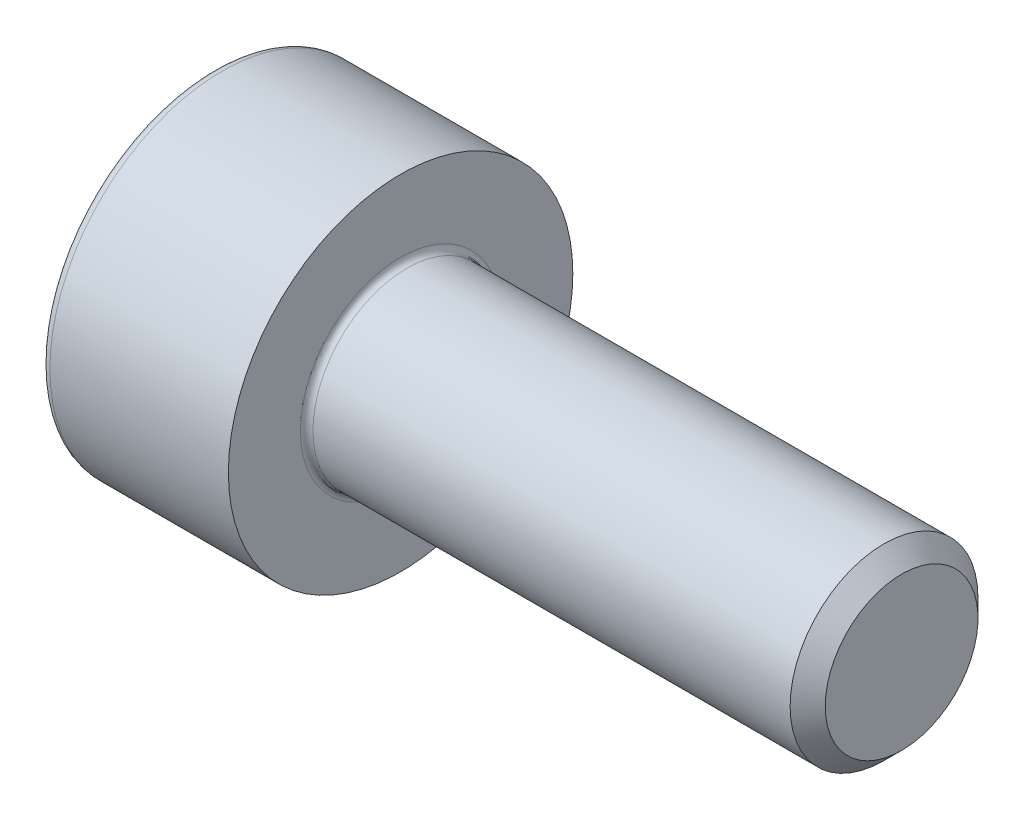
ISO-10303-21;
HEADER;
FILE_DESCRIPTION(('STEP AP214'),'2;1');
FILE_NAME('part.step','',(''),(''),'','','');
FILE_SCHEMA(('AUTOMOTIVE_DESIGN { 1 0 10303 214 1 1 1 1 }'));
ENDSEC;
DATA;
#1=APPLICATION_CONTEXT('core data for automotive mechanical design processes');
#2=APPLICATION_PROTOCOL_DEFINITION('international standard','automotive_design',2000,#1);
#3=PRODUCT_CONTEXT('',#1,'mechanical');
#4=PRODUCT('Part','Part','',(#3));
#5=PRODUCT_RELATED_PRODUCT_CATEGORY('part','',(#4));
#6=PRODUCT_DEFINITION_FORMATION('','',#4);
#7=PRODUCT_DEFINITION_CONTEXT('part definition',#1,'design');
#8=PRODUCT_DEFINITION('design','',#6,#7);
#9=PRODUCT_DEFINITION_SHAPE('','',#8);
#10=(LENGTH_UNIT() NAMED_UNIT(*) SI_UNIT(.MILLI.,.METRE.));
#11=(NAMED_UNIT(*) PLANE_ANGLE_UNIT() SI_UNIT($,.RADIAN.));
#12=(NAMED_UNIT(*) SI_UNIT($,.STERADIAN.) SOLID_ANGLE_UNIT());
#13=UNCERTAINTY_MEASURE_WITH_UNIT(LENGTH_MEASURE(1.E-05),#10,'distance_accuracy_value','');
#14=(GEOMETRIC_REPRESENTATION_CONTEXT(3) GLOBAL_UNCERTAINTY_ASSIGNED_CONTEXT((#13)) GLOBAL_UNIT_ASSIGNED_CONTEXT((#10,
#11,#12)) REPRESENTATION_CONTEXT('',''));
#15=CARTESIAN_POINT('',(0.,0.,0.));
#16=DIRECTION('',(0.,0.,1.));
#17=DIRECTION('',(1.,0.,0.));
#18=AXIS2_PLACEMENT_3D('',#15,#16,#17);
#19=CARTESIAN_POINT('',(0.,0.,0.));
#20=DIRECTION('',(-1.,0.,0.));
#21=DIRECTION('',(0.,0.,1.));
#22=AXIS2_PLACEMENT_3D('',#19,#20,#21);
#23=PLANE('',#22);
#24=DIRECTION('',(0.,-0.499999999999999,0.866025403784439));
#25=VECTOR('',#24,1.);
#26=CARTESIAN_POINT('',(0.,1.47801668912544,0.));
#27=LINE('',#26,#25);
#28=CARTESIAN_POINT('',(0.,1.47801668912544,0.));
#29=VERTEX_POINT('',#28);
#30=CARTESIAN_POINT('',(0.,0.73900834456272,1.28));
#31=VERTEX_POINT('',#30);
#32=EDGE_CURVE('E259',#29,#31,#27,.T.);
#33=ORIENTED_EDGE('',*,*,#32,.T.);
#34=DIRECTION('',(0.,1.,0.));
#35=VECTOR('',#34,1.);
#36=CARTESIAN_POINT('',(0.,-0.739008344562723,1.28));
#37=LINE('',#36,#35);
#38=CARTESIAN_POINT('',(0.,-0.739008344562723,1.28));
#39=VERTEX_POINT('',#38);
#40=EDGE_CURVE('E131',#39,#31,#37,.T.);
#41=ORIENTED_EDGE('',*,*,#40,.F.);
#42=DIRECTION('',(0.,-0.500000000000001,-0.866025403784438));
#43=VECTOR('',#42,1.);
#44=CARTESIAN_POINT('',(0.,-0.739008344562723,1.28));
#45=LINE('',#44,#43);
#46=CARTESIAN_POINT('',(0.,-1.47801668912545,0.));
#47=VERTEX_POINT('',#46);
#48=EDGE_CURVE('E262',#39,#47,#45,.T.);
#49=ORIENTED_EDGE('',*,*,#48,.T.);
#50=DIRECTION('',(0.,0.499999999999999,-0.866025403784439));
#51=VECTOR('',#50,1.);
#52=CARTESIAN_POINT('',(0.,-1.47801668912545,0.));
#53=LINE('',#52,#51);
#54=CARTESIAN_POINT('',(0.,-0.739008344562727,-1.28));
#55=VERTEX_POINT('',#54);
#56=EDGE_CURVE('E265',#47,#55,#53,.T.);
#57=ORIENTED_EDGE('',*,*,#56,.T.);
#58=DIRECTION('',(0.,-1.,0.));
#59=VECTOR('',#58,1.);
#60=CARTESIAN_POINT('',(0.,0.739008344562717,-1.28));
#61=LINE('',#60,#59);
#62=CARTESIAN_POINT('',(0.,0.739008344562717,-1.28));
#63=VERTEX_POINT('',#62);
#64=EDGE_CURVE('E268',#63,#55,#61,.T.);
#65=ORIENTED_EDGE('',*,*,#64,.F.);
#66=DIRECTION('',(0.,-0.500000000000001,-0.866025403784438));
#67=VECTOR('',#66,1.);
#68=CARTESIAN_POINT('',(0.,1.47801668912544,0.));
#69=LINE('',#68,#67);
#70=EDGE_CURVE('E126',#29,#63,#69,.T.);
#71=ORIENTED_EDGE('',*,*,#70,.F.);
#72=EDGE_LOOP('',(#33,#41,#49,#57,#65,#71));
#73=FACE_BOUND('',#72,.T.);
#74=CARTESIAN_POINT('',(0.,0.,0.));
#75=DIRECTION('',(-1.,0.,0.));
#76=DIRECTION('',(0.,0.,1.));
#77=AXIS2_PLACEMENT_3D('',#74,#75,#76);
#78=CIRCLE('',#77,2.6);
#79=CARTESIAN_POINT('',(0.,0.,2.6));
#80=VERTEX_POINT('',#79);
#81=EDGE_CURVE('E43',#80,#80,#78,.T.);
#82=ORIENTED_EDGE('',*,*,#81,.T.);
#83=EDGE_LOOP('',(#82));
#84=FACE_BOUND('',#83,.T.);
#85=ADVANCED_FACE('F35',(#73,#84),#23,.T.);
#86=CARTESIAN_POINT('',(-31.75,0.,0.));
#87=DIRECTION('',(-1.,0.,0.));
#88=DIRECTION('',(0.,0.,1.));
#89=AXIS2_PLACEMENT_3D('',#86,#87,#88);
#90=CYLINDRICAL_SURFACE('',#89,2.75);
#91=CARTESIAN_POINT('',(0.149999999999997,0.,0.));
#92=DIRECTION('',(-1.,0.,0.));
#93=DIRECTION('',(0.,0.,1.));
#94=AXIS2_PLACEMENT_3D('',#91,#92,#93);
#95=CIRCLE('',#94,2.75);
#96=CARTESIAN_POINT('',(0.149999999999997,0.,2.75));
#97=VERTEX_POINT('',#96);
#98=EDGE_CURVE('E11',#97,#97,#95,.F.);
#99=ORIENTED_EDGE('',*,*,#98,.T.);
#100=EDGE_LOOP('',(#99));
#101=FACE_BOUND('',#100,.T.);
#102=CARTESIAN_POINT('',(3.,0.,0.));
#103=DIRECTION('',(-1.,0.,0.));
#104=DIRECTION('',(0.,0.,1.));
#105=AXIS2_PLACEMENT_3D('',#102,#103,#104);
#106=CIRCLE('',#105,2.75);
#107=CARTESIAN_POINT('',(3.,0.,2.75));
#108=VERTEX_POINT('',#107);
#109=EDGE_CURVE('E149',#108,#108,#106,.T.);
#110=ORIENTED_EDGE('',*,*,#109,.T.);
#111=EDGE_LOOP('',(#110));
#112=FACE_BOUND('',#111,.T.);
#113=ADVANCED_FACE('F173',(#101,#112),#90,.T.);
#114=CARTESIAN_POINT('',(3.,2.75,0.));
#115=DIRECTION('',(1.,0.,0.));
#116=DIRECTION('',(0.,0.,-1.));
#117=AXIS2_PLACEMENT_3D('',#114,#115,#116);
#118=PLANE('',#117);
#119=CARTESIAN_POINT('',(3.,0.,0.));
#120=DIRECTION('',(1.,0.,0.));
#121=DIRECTION('',(0.,0.,-1.));
#122=AXIS2_PLACEMENT_3D('',#119,#120,#121);
#123=CIRCLE('',#122,1.59999999999996);
#124=CARTESIAN_POINT('',(3.,0.,-1.59999999999996));
#125=VERTEX_POINT('',#124);
#126=EDGE_CURVE('E152',#125,#125,#123,.F.);
#127=ORIENTED_EDGE('',*,*,#126,.T.);
#128=EDGE_LOOP('',(#127));
#129=FACE_BOUND('',#128,.T.);
#130=ORIENTED_EDGE('',*,*,#109,.F.);
#131=EDGE_LOOP('',(#130));
#132=FACE_BOUND('',#131,.T.);
#133=ADVANCED_FACE('F179',(#129,#132),#118,.T.);
#134=CARTESIAN_POINT('',(-31.75,0.,0.));
#135=DIRECTION('',(-1.,0.,0.));
#136=DIRECTION('',(0.,0.,1.));
#137=AXIS2_PLACEMENT_3D('',#134,#135,#136);
#138=CYLINDRICAL_SURFACE('',#137,1.49999999999996);
#139=CARTESIAN_POINT('',(3.1,0.,0.));
#140=DIRECTION('',(1.,0.,0.));
#141=DIRECTION('',(0.,0.,-1.));
#142=AXIS2_PLACEMENT_3D('',#139,#140,#141);
#143=CIRCLE('',#142,1.49999999999996);
#144=CARTESIAN_POINT('',(3.1,0.,-1.49999999999996));
#145=VERTEX_POINT('',#144);
#146=EDGE_CURVE('E155',#145,#145,#143,.T.);
#147=ORIENTED_EDGE('',*,*,#146,.T.);
#148=EDGE_LOOP('',(#147));
#149=FACE_BOUND('',#148,.T.);
#150=CARTESIAN_POINT('',(10.7194999999999,0.,0.));
#151=DIRECTION('',(-1.,0.,0.));
#152=DIRECTION('',(0.,0.,1.));
#153=AXIS2_PLACEMENT_3D('',#150,#151,#152);
#154=CIRCLE('',#153,1.49999999999993);
#155=CARTESIAN_POINT('',(10.7194999999999,0.,1.49999999999993));
#156=VERTEX_POINT('',#155);
#157=EDGE_CURVE('E146',#156,#156,#154,.T.);
#158=ORIENTED_EDGE('',*,*,#157,.T.);
#159=EDGE_LOOP('',(#158));
#160=FACE_BOUND('',#159,.T.);
#161=ADVANCED_FACE('F185',(#149,#160),#138,.T.);
#162=CARTESIAN_POINT('',(11.,0.,0.));
#163=DIRECTION('',(-1.,0.,0.));
#164=DIRECTION('',(0.,0.,1.));
#165=AXIS2_PLACEMENT_3D('',#162,#163,#164);
#166=CONICAL_SURFACE('',#165,1.2195,0.785398163397216);
#167=ORIENTED_EDGE('',*,*,#157,.F.);
#168=EDGE_LOOP('',(#167));
#169=FACE_BOUND('',#168,.T.);
#170=CARTESIAN_POINT('',(11.,0.,0.));
#171=DIRECTION('',(-1.,0.,0.));
#172=DIRECTION('',(0.,0.,1.));
#173=AXIS2_PLACEMENT_3D('',#170,#171,#172);
#174=CIRCLE('',#173,1.2195);
#175=CARTESIAN_POINT('',(11.,0.,1.2195));
#176=VERTEX_POINT('',#175);
#177=EDGE_CURVE('E142',#176,#176,#174,.T.);
#178=ORIENTED_EDGE('',*,*,#177,.T.);
#179=EDGE_LOOP('',(#178));
#180=FACE_BOUND('',#179,.T.);
#181=ADVANCED_FACE('F189',(#169,#180),#166,.T.);
#182=CARTESIAN_POINT('',(11.,1.2195,0.));
#183=DIRECTION('',(1.,0.,0.));
#184=DIRECTION('',(0.,0.,-1.));
#185=AXIS2_PLACEMENT_3D('',#182,#183,#184);
#186=PLANE('',#185);
#187=ORIENTED_EDGE('',*,*,#177,.F.);
#188=EDGE_LOOP('',(#187));
#189=FACE_BOUND('',#188,.T.);
#190=ADVANCED_FACE('F169',(#189),#186,.T.);
#191=CARTESIAN_POINT('',(3.1,0.,0.));
#192=DIRECTION('',(1.,0.,0.));
#193=DIRECTION('',(0.,0.,-1.));
#194=AXIS2_PLACEMENT_3D('',#191,#192,#193);
#195=TOROIDAL_SURFACE('',#194,1.59999999999996,0.1);
#196=ORIENTED_EDGE('',*,*,#146,.F.);
#197=EDGE_LOOP('',(#196));
#198=FACE_BOUND('',#197,.T.);
#199=ORIENTED_EDGE('',*,*,#126,.F.);
#200=EDGE_LOOP('',(#199));
#201=FACE_BOUND('',#200,.T.);
#202=ADVANCED_FACE('F162',(#198,#201),#195,.F.);
#203=CARTESIAN_POINT('',(0.149999999999997,0.,0.));
#204=DIRECTION('',(-1.,0.,0.));
#205=DIRECTION('',(0.,0.,1.));
#206=AXIS2_PLACEMENT_3D('',#203,#204,#205);
#207=TOROIDAL_SURFACE('',#206,2.6,0.15);
#208=ORIENTED_EDGE('',*,*,#98,.F.);
#209=EDGE_LOOP('',(#208));
#210=FACE_BOUND('',#209,.T.);
#211=ORIENTED_EDGE('',*,*,#81,.F.);
#212=EDGE_LOOP('',(#211));
#213=FACE_BOUND('',#212,.T.);
#214=ADVANCED_FACE('F37',(#210,#213),#207,.T.);
#215=CARTESIAN_POINT('',(1.3,1.47801668912544,0.));
#216=DIRECTION('',(0.,-0.866025403784439,-0.499999999999999));
#217=DIRECTION('',(0.,0.499999999999999,-0.866025403784439));
#218=AXIS2_PLACEMENT_3D('',#215,#216,#217);
#219=PLANE('',#218);
#220=ORIENTED_EDGE('',*,*,#32,.F.);
#221=DIRECTION('',(-1.,0.,0.));
#222=VECTOR('',#221,1.);
#223=CARTESIAN_POINT('',(1.3,1.47801668912544,0.));
#224=LINE('',#223,#222);
#225=CARTESIAN_POINT('',(1.3,1.47801668912544,0.));
#226=VERTEX_POINT('',#225);
#227=EDGE_CURVE('E249',#226,#29,#224,.T.);
#228=ORIENTED_EDGE('',*,*,#227,.F.);
#229=DIRECTION('',(0.,-0.499999999999999,0.866025403784439));
#230=VECTOR('',#229,1.);
#231=CARTESIAN_POINT('',(1.3,1.47801668912544,0.));
#232=LINE('',#231,#230);
#233=CARTESIAN_POINT('',(1.3,1.10851251684408,0.639999999999997));
#234=VERTEX_POINT('',#233);
#235=EDGE_CURVE('E118',#226,#234,#232,.T.);
#236=ORIENTED_EDGE('',*,*,#235,.T.);
#237=CARTESIAN_POINT('',(1.3,0.73900834456272,1.28));
#238=VERTEX_POINT('',#237);
#239=EDGE_CURVE('E109',#234,#238,#232,.T.);
#240=ORIENTED_EDGE('',*,*,#239,.T.);
#241=DIRECTION('',(-1.,0.,0.));
#242=VECTOR('',#241,1.);
#243=CARTESIAN_POINT('',(1.3,0.73900834456272,1.28));
#244=LINE('',#243,#242);
#245=EDGE_CURVE('E123',#238,#31,#244,.T.);
#246=ORIENTED_EDGE('',*,*,#245,.T.);
#247=EDGE_LOOP('',(#220,#228,#236,#240,#246));
#248=FACE_BOUND('',#247,.T.);
#249=ADVANCED_FACE('F122',(#248),#219,.T.);
#250=CARTESIAN_POINT('',(1.3,-0.739008344562723,1.28));
#251=DIRECTION('',(0.,0.,1.));
#252=DIRECTION('',(0.,-1.,0.));
#253=AXIS2_PLACEMENT_3D('',#250,#251,#252);
#254=PLANE('',#253);
#255=ORIENTED_EDGE('',*,*,#40,.T.);
#256=ORIENTED_EDGE('',*,*,#245,.F.);
#257=DIRECTION('',(0.,1.,0.));
#258=VECTOR('',#257,1.);
#259=CARTESIAN_POINT('',(1.3,-0.739008344562723,1.28));
#260=LINE('',#259,#258);
#261=CARTESIAN_POINT('',(1.3,0.,1.28));
#262=VERTEX_POINT('',#261);
#263=EDGE_CURVE('E106',#262,#238,#260,.T.);
#264=ORIENTED_EDGE('',*,*,#263,.F.);
#265=CARTESIAN_POINT('',(1.3,-0.739008344562723,1.28));
#266=VERTEX_POINT('',#265);
#267=EDGE_CURVE('E117',#266,#262,#260,.T.);
#268=ORIENTED_EDGE('',*,*,#267,.F.);
#269=DIRECTION('',(-1.,0.,0.));
#270=VECTOR('',#269,1.);
#271=CARTESIAN_POINT('',(1.3,-0.739008344562723,1.28));
#272=LINE('',#271,#270);
#273=EDGE_CURVE('E133',#266,#39,#272,.T.);
#274=ORIENTED_EDGE('',*,*,#273,.T.);
#275=EDGE_LOOP('',(#255,#256,#264,#268,#274));
#276=FACE_BOUND('',#275,.T.);
#277=ADVANCED_FACE('F128',(#276),#254,.F.);
#278=CARTESIAN_POINT('',(1.3,-0.739008344562723,1.28));
#279=DIRECTION('',(0.,0.866025403784438,-0.500000000000001));
#280=DIRECTION('',(0.,0.500000000000001,0.866025403784438));
#281=AXIS2_PLACEMENT_3D('',#278,#279,#280);
#282=PLANE('',#281);
#283=ORIENTED_EDGE('',*,*,#48,.F.);
#284=ORIENTED_EDGE('',*,*,#273,.F.);
#285=DIRECTION('',(0.,-0.500000000000001,-0.866025403784438));
#286=VECTOR('',#285,1.);
#287=CARTESIAN_POINT('',(1.3,-0.739008344562723,1.28));
#288=LINE('',#287,#286);
#289=CARTESIAN_POINT('',(1.3,-1.10851251684408,0.640000000000002));
#290=VERTEX_POINT('',#289);
#291=EDGE_CURVE('E288',#266,#290,#288,.T.);
#292=ORIENTED_EDGE('',*,*,#291,.T.);
#293=CARTESIAN_POINT('',(1.3,-1.47801668912545,0.));
#294=VERTEX_POINT('',#293);
#295=EDGE_CURVE('E277',#290,#294,#288,.T.);
#296=ORIENTED_EDGE('',*,*,#295,.T.);
#297=DIRECTION('',(-1.,0.,0.));
#298=VECTOR('',#297,1.);
#299=CARTESIAN_POINT('',(1.3,-1.47801668912545,0.));
#300=LINE('',#299,#298);
#301=EDGE_CURVE('E138',#294,#47,#300,.T.);
#302=ORIENTED_EDGE('',*,*,#301,.T.);
#303=EDGE_LOOP('',(#283,#284,#292,#296,#302));
#304=FACE_BOUND('',#303,.T.);
#305=ADVANCED_FACE('F203',(#304),#282,.T.);
#306=CARTESIAN_POINT('',(1.3,-1.47801668912545,0.));
#307=DIRECTION('',(0.,0.866025403784439,0.499999999999999));
#308=DIRECTION('',(0.,-0.499999999999999,0.866025403784439));
#309=AXIS2_PLACEMENT_3D('',#306,#307,#308);
#310=PLANE('',#309);
#311=ORIENTED_EDGE('',*,*,#56,.F.);
#312=ORIENTED_EDGE('',*,*,#301,.F.);
#313=DIRECTION('',(0.,0.499999999999999,-0.866025403784439));
#314=VECTOR('',#313,1.);
#315=CARTESIAN_POINT('',(1.3,-1.47801668912545,0.));
#316=LINE('',#315,#314);
#317=CARTESIAN_POINT('',(1.3,-1.10851251684409,-0.640000000000001));
#318=VERTEX_POINT('',#317);
#319=EDGE_CURVE('E255',#294,#318,#316,.T.);
#320=ORIENTED_EDGE('',*,*,#319,.T.);
#321=CARTESIAN_POINT('',(1.3,-0.739008344562727,-1.28));
#322=VERTEX_POINT('',#321);
#323=EDGE_CURVE('E287',#318,#322,#316,.T.);
#324=ORIENTED_EDGE('',*,*,#323,.T.);
#325=DIRECTION('',(-1.,0.,0.));
#326=VECTOR('',#325,1.);
#327=CARTESIAN_POINT('',(1.3,-0.739008344562727,-1.28));
#328=LINE('',#327,#326);
#329=EDGE_CURVE('E248',#322,#55,#328,.T.);
#330=ORIENTED_EDGE('',*,*,#329,.T.);
#331=EDGE_LOOP('',(#311,#312,#320,#324,#330));
#332=FACE_BOUND('',#331,.T.);
#333=ADVANCED_FACE('F206',(#332),#310,.T.);
#334=CARTESIAN_POINT('',(1.3,0.739008344562717,-1.28));
#335=DIRECTION('',(0.,0.,-1.));
#336=DIRECTION('',(0.,1.,0.));
#337=AXIS2_PLACEMENT_3D('',#334,#335,#336);
#338=PLANE('',#337);
#339=ORIENTED_EDGE('',*,*,#64,.T.);
#340=ORIENTED_EDGE('',*,*,#329,.F.);
#341=DIRECTION('',(0.,-1.,0.));
#342=VECTOR('',#341,1.);
#343=CARTESIAN_POINT('',(1.3,0.739008344562717,-1.28));
#344=LINE('',#343,#342);
#345=CARTESIAN_POINT('',(1.3,0.,-1.28));
#346=VERTEX_POINT('',#345);
#347=EDGE_CURVE('E252',#346,#322,#344,.T.);
#348=ORIENTED_EDGE('',*,*,#347,.F.);
#349=CARTESIAN_POINT('',(1.3,0.739008344562717,-1.28));
#350=VERTEX_POINT('',#349);
#351=EDGE_CURVE('E50',#350,#346,#344,.T.);
#352=ORIENTED_EDGE('',*,*,#351,.F.);
#353=DIRECTION('',(-1.,0.,0.));
#354=VECTOR('',#353,1.);
#355=CARTESIAN_POINT('',(1.3,0.739008344562717,-1.28));
#356=LINE('',#355,#354);
#357=EDGE_CURVE('E245',#350,#63,#356,.T.);
#358=ORIENTED_EDGE('',*,*,#357,.T.);
#359=EDGE_LOOP('',(#339,#340,#348,#352,#358));
#360=FACE_BOUND('',#359,.T.);
#361=ADVANCED_FACE('F210',(#360),#338,.F.);
#362=CARTESIAN_POINT('',(1.3,1.47801668912544,0.));
#363=DIRECTION('',(0.,0.866025403784438,-0.500000000000001));
#364=DIRECTION('',(0.,0.500000000000001,0.866025403784438));
#365=AXIS2_PLACEMENT_3D('',#362,#363,#364);
#366=PLANE('',#365);
#367=ORIENTED_EDGE('',*,*,#70,.T.);
#368=ORIENTED_EDGE('',*,*,#357,.F.);
#369=DIRECTION('',(0.,-0.500000000000001,-0.866025403784438));
#370=VECTOR('',#369,1.);
#371=CARTESIAN_POINT('',(1.3,1.47801668912544,0.));
#372=LINE('',#371,#370);
#373=CARTESIAN_POINT('',(1.3,1.10851251684408,-0.640000000000001));
#374=VERTEX_POINT('',#373);
#375=EDGE_CURVE('E235',#374,#350,#372,.T.);
#376=ORIENTED_EDGE('',*,*,#375,.F.);
#377=EDGE_CURVE('E241',#226,#374,#372,.T.);
#378=ORIENTED_EDGE('',*,*,#377,.F.);
#379=ORIENTED_EDGE('',*,*,#227,.T.);
#380=EDGE_LOOP('',(#367,#368,#376,#378,#379));
#381=FACE_BOUND('',#380,.T.);
#382=ADVANCED_FACE('F214',(#381),#366,.F.);
#383=CARTESIAN_POINT('',(1.3,1.47801668912544,0.));
#384=DIRECTION('',(1.,0.,0.));
#385=DIRECTION('',(0.,0.,-1.));
#386=AXIS2_PLACEMENT_3D('',#383,#384,#385);
#387=PLANE('',#386);
#388=ORIENTED_EDGE('',*,*,#347,.T.);
#389=ORIENTED_EDGE('',*,*,#323,.F.);
#390=CARTESIAN_POINT('',(1.3,0.,0.));
#391=DIRECTION('',(-1.,0.,0.));
#392=DIRECTION('',(0.,0.,1.));
#393=AXIS2_PLACEMENT_3D('',#390,#391,#392);
#394=CIRCLE('',#393,1.28);
#395=EDGE_CURVE('E283',#346,#318,#394,.T.);
#396=ORIENTED_EDGE('',*,*,#395,.F.);
#397=EDGE_LOOP('',(#388,#389,#396));
#398=FACE_BOUND('',#397,.T.);
#399=ADVANCED_FACE('F218',(#398),#387,.F.);
#400=ORIENTED_EDGE('',*,*,#319,.F.);
#401=ORIENTED_EDGE('',*,*,#295,.F.);
#402=EDGE_CURVE('E136',#318,#290,#394,.T.);
#403=ORIENTED_EDGE('',*,*,#402,.F.);
#404=EDGE_LOOP('',(#400,#401,#403));
#405=FACE_BOUND('',#404,.T.);
#406=ADVANCED_FACE('F221',(#405),#387,.F.);
#407=ORIENTED_EDGE('',*,*,#291,.F.);
#408=ORIENTED_EDGE('',*,*,#267,.T.);
#409=EDGE_CURVE('E132',#290,#262,#394,.T.);
#410=ORIENTED_EDGE('',*,*,#409,.F.);
#411=EDGE_LOOP('',(#407,#408,#410));
#412=FACE_BOUND('',#411,.T.);
#413=ADVANCED_FACE('F226',(#412),#387,.F.);
#414=ORIENTED_EDGE('',*,*,#263,.T.);
#415=ORIENTED_EDGE('',*,*,#239,.F.);
#416=EDGE_CURVE('E112',#262,#234,#394,.T.);
#417=ORIENTED_EDGE('',*,*,#416,.F.);
#418=EDGE_LOOP('',(#414,#415,#417));
#419=FACE_BOUND('',#418,.T.);
#420=ADVANCED_FACE('F108',(#419),#387,.F.);
#421=ORIENTED_EDGE('',*,*,#235,.F.);
#422=ORIENTED_EDGE('',*,*,#377,.T.);
#423=EDGE_CURVE('E143',#234,#374,#394,.T.);
#424=ORIENTED_EDGE('',*,*,#423,.F.);
#425=EDGE_LOOP('',(#421,#422,#424));
#426=FACE_BOUND('',#425,.T.);
#427=ADVANCED_FACE('F229',(#426),#387,.F.);
#428=ORIENTED_EDGE('',*,*,#375,.T.);
#429=ORIENTED_EDGE('',*,*,#351,.T.);
#430=EDGE_CURVE('E238',#374,#346,#394,.T.);
#431=ORIENTED_EDGE('',*,*,#430,.F.);
#432=EDGE_LOOP('',(#428,#429,#431));
#433=FACE_BOUND('',#432,.T.);
#434=ADVANCED_FACE('F199',(#433),#387,.F.);
#435=CARTESIAN_POINT('',(1.3,0.,0.));
#436=DIRECTION('',(-1.,0.,0.));
#437=DIRECTION('',(0.,0.,1.));
#438=AXIS2_PLACEMENT_3D('',#435,#436,#437);
#439=CONICAL_SURFACE('',#438,1.28,1.04719755119659);
#440=CARTESIAN_POINT('',(2.03900834456273,0.,0.));
#441=VERTEX_POINT('',#440);
#442=VERTEX_LOOP('',#441);
#443=FACE_BOUND('',#442,.T.);
#444=ORIENTED_EDGE('',*,*,#416,.T.);
#445=ORIENTED_EDGE('',*,*,#423,.T.);
#446=ORIENTED_EDGE('',*,*,#430,.T.);
#447=ORIENTED_EDGE('',*,*,#395,.T.);
#448=ORIENTED_EDGE('',*,*,#402,.T.);
#449=ORIENTED_EDGE('',*,*,#409,.T.);
#450=EDGE_LOOP('',(#444,#445,#446,#447,#448,#449));
#451=FACE_BOUND('',#450,.T.);
#452=ADVANCED_FACE('F197',(#443,#451),#439,.F.);
#453=CLOSED_SHELL('',(#85,#113,#133,#161,#181,#190,#202,#214,#249,#277,#305,#333,#361,#382,#399,
#406,#413,#420,#427,#434,#452));
#454=MANIFOLD_SOLID_BREP('B2',#453);
#455=ADVANCED_BREP_SHAPE_REPRESENTATION('',(#18,#454),#14);
#456=SHAPE_DEFINITION_REPRESENTATION(#9,#455);
ENDSEC;
END-ISO-10303-21;
